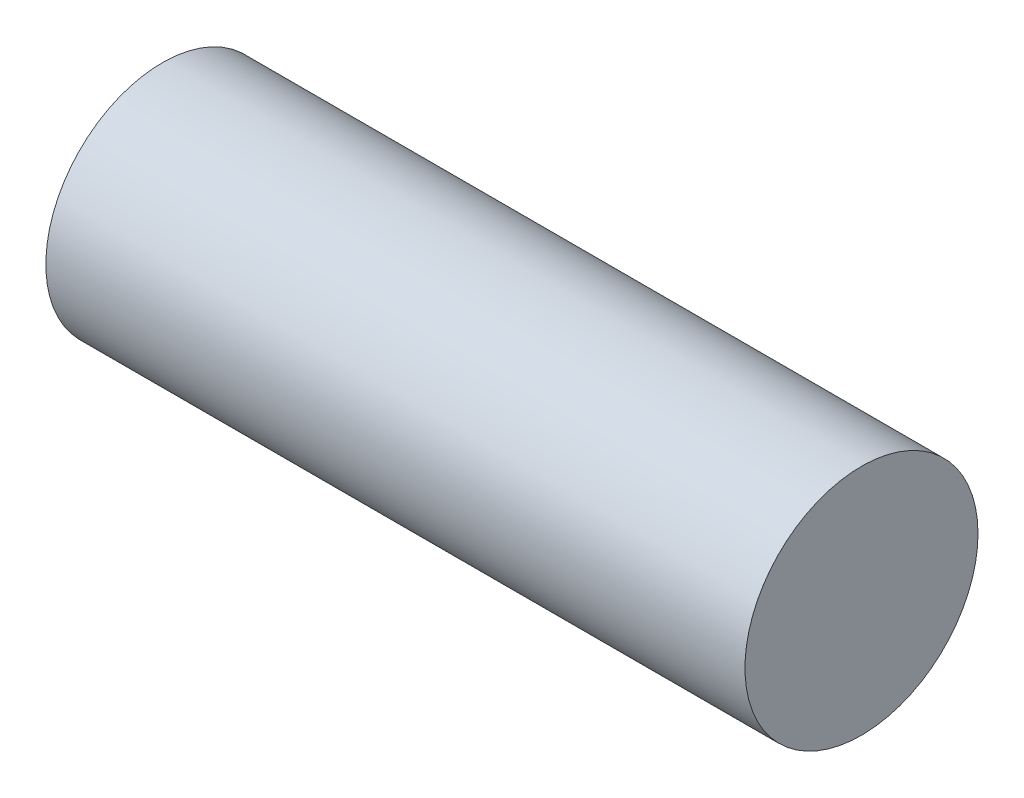
ISO-10303-21;
HEADER;
FILE_DESCRIPTION(('STEP AP214'),'2;1');
FILE_NAME('part.step','',(''),(''),'','','');
FILE_SCHEMA(('AUTOMOTIVE_DESIGN { 1 0 10303 214 1 1 1 1 }'));
ENDSEC;
DATA;
#1=APPLICATION_CONTEXT('core data for automotive mechanical design processes');
#2=APPLICATION_PROTOCOL_DEFINITION('international standard','automotive_design',2000,#1);
#3=PRODUCT_CONTEXT('',#1,'mechanical');
#4=PRODUCT('Part','Part','',(#3));
#5=PRODUCT_RELATED_PRODUCT_CATEGORY('part','',(#4));
#6=PRODUCT_DEFINITION_FORMATION('','',#4);
#7=PRODUCT_DEFINITION_CONTEXT('part definition',#1,'design');
#8=PRODUCT_DEFINITION('design','',#6,#7);
#9=PRODUCT_DEFINITION_SHAPE('','',#8);
#10=(LENGTH_UNIT() NAMED_UNIT(*) SI_UNIT(.MILLI.,.METRE.));
#11=(NAMED_UNIT(*) PLANE_ANGLE_UNIT() SI_UNIT($,.RADIAN.));
#12=(NAMED_UNIT(*) SI_UNIT($,.STERADIAN.) SOLID_ANGLE_UNIT());
#13=UNCERTAINTY_MEASURE_WITH_UNIT(LENGTH_MEASURE(1.E-05),#10,'distance_accuracy_value','');
#14=(GEOMETRIC_REPRESENTATION_CONTEXT(3) GLOBAL_UNCERTAINTY_ASSIGNED_CONTEXT((#13)) GLOBAL_UNIT_ASSIGNED_CONTEXT((#10,
#11,#12)) REPRESENTATION_CONTEXT('',''));
#15=CARTESIAN_POINT('',(0.,0.,0.));
#16=DIRECTION('',(0.,0.,1.));
#17=DIRECTION('',(1.,0.,0.));
#18=AXIS2_PLACEMENT_3D('',#15,#16,#17);
#19=CARTESIAN_POINT('',(15.,0.,0.));
#20=DIRECTION('',(-1.,0.,0.));
#21=DIRECTION('',(0.,0.,1.));
#22=AXIS2_PLACEMENT_3D('',#19,#20,#21);
#23=CYLINDRICAL_SURFACE('',#22,5.);
#24=CARTESIAN_POINT('',(15.,0.,0.));
#25=DIRECTION('',(1.,0.,0.));
#26=DIRECTION('',(0.,0.,-1.));
#27=AXIS2_PLACEMENT_3D('',#24,#25,#26);
#28=CIRCLE('',#27,5.);
#29=CARTESIAN_POINT('',(15.,0.,-5.));
#30=VERTEX_POINT('',#29);
#31=EDGE_CURVE('E10',#30,#30,#28,.T.);
#32=ORIENTED_EDGE('',*,*,#31,.F.);
#33=EDGE_LOOP('',(#32));
#34=FACE_BOUND('',#33,.T.);
#35=CARTESIAN_POINT('',(-15.,0.,0.));
#36=DIRECTION('',(1.,0.,0.));
#37=DIRECTION('',(0.,0.,-1.));
#38=AXIS2_PLACEMENT_3D('',#35,#36,#37);
#39=CIRCLE('',#38,5.);
#40=CARTESIAN_POINT('',(-15.,0.,-5.));
#41=VERTEX_POINT('',#40);
#42=EDGE_CURVE('E39',#41,#41,#39,.T.);
#43=ORIENTED_EDGE('',*,*,#42,.T.);
#44=EDGE_LOOP('',(#43));
#45=FACE_BOUND('',#44,.T.);
#46=ADVANCED_FACE('F36',(#34,#45),#23,.T.);
#47=CARTESIAN_POINT('',(15.,0.,0.));
#48=DIRECTION('',(1.,0.,0.));
#49=DIRECTION('',(0.,0.,-1.));
#50=AXIS2_PLACEMENT_3D('',#47,#48,#49);
#51=PLANE('',#50);
#52=ORIENTED_EDGE('',*,*,#31,.T.);
#53=EDGE_LOOP('',(#52));
#54=FACE_BOUND('',#53,.T.);
#55=ADVANCED_FACE('F51',(#54),#51,.T.);
#56=CARTESIAN_POINT('',(-15.,0.,0.));
#57=DIRECTION('',(1.,0.,0.));
#58=DIRECTION('',(0.,0.,-1.));
#59=AXIS2_PLACEMENT_3D('',#56,#57,#58);
#60=PLANE('',#59);
#61=ORIENTED_EDGE('',*,*,#42,.F.);
#62=EDGE_LOOP('',(#61));
#63=FACE_BOUND('',#62,.T.);
#64=ADVANCED_FACE('F49',(#63),#60,.F.);
#65=CLOSED_SHELL('',(#46,#55,#64));
#66=MANIFOLD_SOLID_BREP('B2',#65);
#67=ADVANCED_BREP_SHAPE_REPRESENTATION('',(#18,#66),#14);
#68=SHAPE_DEFINITION_REPRESENTATION(#9,#67);
ENDSEC;
END-ISO-10303-21;
